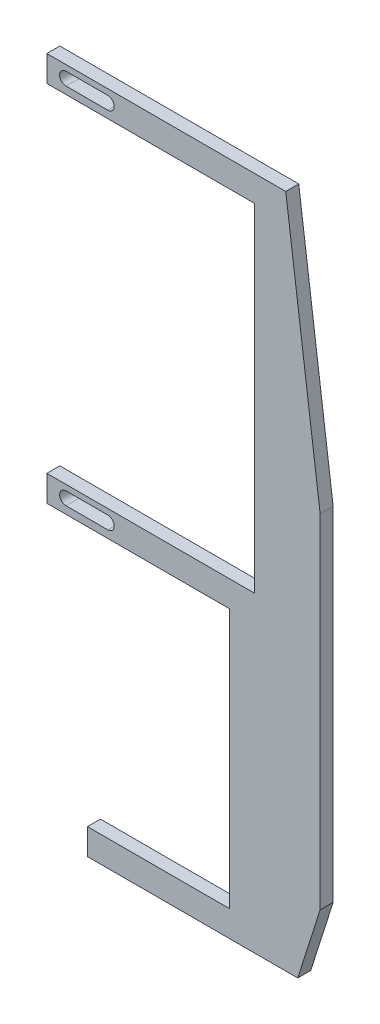
ISO-10303-21;
HEADER;
FILE_DESCRIPTION(('STEP AP214'),'2;1');
FILE_NAME('part.step','',(''),(''),'','','');
FILE_SCHEMA(('AUTOMOTIVE_DESIGN { 1 0 10303 214 1 1 1 1 }'));
ENDSEC;
DATA;
#1=APPLICATION_CONTEXT('core data for automotive mechanical design processes');
#2=APPLICATION_PROTOCOL_DEFINITION('international standard','automotive_design',2000,#1);
#3=PRODUCT_CONTEXT('',#1,'mechanical');
#4=PRODUCT('Part','Part','',(#3));
#5=PRODUCT_RELATED_PRODUCT_CATEGORY('part','',(#4));
#6=PRODUCT_DEFINITION_FORMATION('','',#4);
#7=PRODUCT_DEFINITION_CONTEXT('part definition',#1,'design');
#8=PRODUCT_DEFINITION('design','',#6,#7);
#9=PRODUCT_DEFINITION_SHAPE('','',#8);
#10=(LENGTH_UNIT() NAMED_UNIT(*) SI_UNIT(.MILLI.,.METRE.));
#11=(NAMED_UNIT(*) PLANE_ANGLE_UNIT() SI_UNIT($,.RADIAN.));
#12=(NAMED_UNIT(*) SI_UNIT($,.STERADIAN.) SOLID_ANGLE_UNIT());
#13=UNCERTAINTY_MEASURE_WITH_UNIT(LENGTH_MEASURE(1.E-05),#10,'distance_accuracy_value','');
#14=(GEOMETRIC_REPRESENTATION_CONTEXT(3) GLOBAL_UNCERTAINTY_ASSIGNED_CONTEXT((#13)) GLOBAL_UNIT_ASSIGNED_CONTEXT((#10,
#11,#12)) REPRESENTATION_CONTEXT('',''));
#15=CARTESIAN_POINT('',(0.,0.,0.));
#16=DIRECTION('',(0.,0.,1.));
#17=DIRECTION('',(1.,0.,0.));
#18=AXIS2_PLACEMENT_3D('',#15,#16,#17);
#19=CARTESIAN_POINT('',(66.833453825743,-57.719185395784,3.175));
#20=DIRECTION('',(-0.991487693439748,-0.130200436856135,0.));
#21=DIRECTION('',(0.130200436856135,-0.991487693439748,0.));
#22=AXIS2_PLACEMENT_3D('',#19,#20,#21);
#23=PLANE('',#22);
#24=DIRECTION('',(-0.130200436856135,0.991487693439748,0.));
#25=VECTOR('',#24,1.);
#26=CARTESIAN_POINT('',(66.833453825743,-57.719185395784,0.));
#27=LINE('',#26,#25);
#28=CARTESIAN_POINT('',(66.833453825743,-57.719185395784,0.));
#29=VERTEX_POINT('',#28);
#30=CARTESIAN_POINT('',(58.42,6.35000000000001,0.));
#31=VERTEX_POINT('',#30);
#32=EDGE_CURVE('E238',#29,#31,#27,.T.);
#33=ORIENTED_EDGE('',*,*,#32,.T.);
#34=DIRECTION('',(0.,0.,-1.));
#35=VECTOR('',#34,1.);
#36=CARTESIAN_POINT('',(58.42,6.35000000000001,3.175));
#37=LINE('',#36,#35);
#38=CARTESIAN_POINT('',(58.42,6.35000000000001,3.175));
#39=VERTEX_POINT('',#38);
#40=EDGE_CURVE('E11',#39,#31,#37,.T.);
#41=ORIENTED_EDGE('',*,*,#40,.F.);
#42=DIRECTION('',(-0.130200436856135,0.991487693439748,0.));
#43=VECTOR('',#42,1.);
#44=CARTESIAN_POINT('',(66.833453825743,-57.719185395784,3.175));
#45=LINE('',#44,#43);
#46=CARTESIAN_POINT('',(66.833453825743,-57.719185395784,3.175));
#47=VERTEX_POINT('',#46);
#48=EDGE_CURVE('E286',#47,#39,#45,.T.);
#49=ORIENTED_EDGE('',*,*,#48,.F.);
#50=DIRECTION('',(0.,0.,-1.));
#51=VECTOR('',#50,1.);
#52=CARTESIAN_POINT('',(66.833453825743,-57.719185395784,3.175));
#53=LINE('',#52,#51);
#54=EDGE_CURVE('E330',#47,#29,#53,.T.);
#55=ORIENTED_EDGE('',*,*,#54,.T.);
#56=EDGE_LOOP('',(#33,#41,#49,#55));
#57=FACE_BOUND('',#56,.T.);
#58=ADVANCED_FACE('F43',(#57),#23,.F.);
#59=CARTESIAN_POINT('',(58.42,6.35000000000001,3.175));
#60=DIRECTION('',(0.,-1.,0.));
#61=DIRECTION('',(1.,0.,0.));
#62=AXIS2_PLACEMENT_3D('',#59,#60,#61);
#63=PLANE('',#62);
#64=DIRECTION('',(-1.,0.,0.));
#65=VECTOR('',#64,1.);
#66=CARTESIAN_POINT('',(58.42,6.35000000000001,0.));
#67=LINE('',#66,#65);
#68=CARTESIAN_POINT('',(0.,6.35,0.));
#69=VERTEX_POINT('',#68);
#70=EDGE_CURVE('E334',#31,#69,#67,.T.);
#71=ORIENTED_EDGE('',*,*,#70,.T.);
#72=DIRECTION('',(0.,0.,-1.));
#73=VECTOR('',#72,1.);
#74=CARTESIAN_POINT('',(0.,6.35,3.175));
#75=LINE('',#74,#73);
#76=CARTESIAN_POINT('',(0.,6.35,3.175));
#77=VERTEX_POINT('',#76);
#78=EDGE_CURVE('E51',#77,#69,#75,.T.);
#79=ORIENTED_EDGE('',*,*,#78,.F.);
#80=DIRECTION('',(-1.,0.,0.));
#81=VECTOR('',#80,1.);
#82=CARTESIAN_POINT('',(58.42,6.35000000000001,3.175));
#83=LINE('',#82,#81);
#84=EDGE_CURVE('E290',#39,#77,#83,.T.);
#85=ORIENTED_EDGE('',*,*,#84,.F.);
#86=ORIENTED_EDGE('',*,*,#40,.T.);
#87=EDGE_LOOP('',(#71,#79,#85,#86));
#88=FACE_BOUND('',#87,.T.);
#89=ADVANCED_FACE('F446',(#88),#63,.F.);
#90=CARTESIAN_POINT('',(0.,6.35,3.175));
#91=DIRECTION('',(1.,0.,0.));
#92=DIRECTION('',(0.,1.,0.));
#93=AXIS2_PLACEMENT_3D('',#90,#91,#92);
#94=PLANE('',#93);
#95=DIRECTION('',(0.,-1.,0.));
#96=VECTOR('',#95,1.);
#97=CARTESIAN_POINT('',(0.,6.35,0.));
#98=LINE('',#97,#96);
#99=CARTESIAN_POINT('',(0.,0.,0.));
#100=VERTEX_POINT('',#99);
#101=EDGE_CURVE('E337',#69,#100,#98,.T.);
#102=ORIENTED_EDGE('',*,*,#101,.T.);
#103=DIRECTION('',(0.,0.,-1.));
#104=VECTOR('',#103,1.);
#105=CARTESIAN_POINT('',(0.,0.,3.175));
#106=LINE('',#105,#104);
#107=CARTESIAN_POINT('',(0.,0.,3.175));
#108=VERTEX_POINT('',#107);
#109=EDGE_CURVE('E415',#108,#100,#106,.T.);
#110=ORIENTED_EDGE('',*,*,#109,.F.);
#111=DIRECTION('',(0.,-1.,0.));
#112=VECTOR('',#111,1.);
#113=CARTESIAN_POINT('',(0.,6.35,3.175));
#114=LINE('',#113,#112);
#115=EDGE_CURVE('E294',#77,#108,#114,.T.);
#116=ORIENTED_EDGE('',*,*,#115,.F.);
#117=ORIENTED_EDGE('',*,*,#78,.T.);
#118=EDGE_LOOP('',(#102,#110,#116,#117));
#119=FACE_BOUND('',#118,.T.);
#120=ADVANCED_FACE('F424',(#119),#94,.F.);
#121=CARTESIAN_POINT('',(0.,0.,3.175));
#122=DIRECTION('',(0.,1.,0.));
#123=DIRECTION('',(0.,0.,1.));
#124=AXIS2_PLACEMENT_3D('',#121,#122,#123);
#125=PLANE('',#124);
#126=DIRECTION('',(1.,0.,0.));
#127=VECTOR('',#126,1.);
#128=CARTESIAN_POINT('',(0.,0.,0.));
#129=LINE('',#128,#127);
#130=CARTESIAN_POINT('',(50.8,0.,0.));
#131=VERTEX_POINT('',#130);
#132=EDGE_CURVE('E340',#100,#131,#129,.T.);
#133=ORIENTED_EDGE('',*,*,#132,.T.);
#134=DIRECTION('',(0.,0.,-1.));
#135=VECTOR('',#134,1.);
#136=CARTESIAN_POINT('',(50.8,0.,3.175));
#137=LINE('',#136,#135);
#138=CARTESIAN_POINT('',(50.8,0.,3.175));
#139=VERTEX_POINT('',#138);
#140=EDGE_CURVE('E411',#139,#131,#137,.T.);
#141=ORIENTED_EDGE('',*,*,#140,.F.);
#142=DIRECTION('',(1.,0.,0.));
#143=VECTOR('',#142,1.);
#144=CARTESIAN_POINT('',(0.,0.,3.175));
#145=LINE('',#144,#143);
#146=EDGE_CURVE('E297',#108,#139,#145,.T.);
#147=ORIENTED_EDGE('',*,*,#146,.F.);
#148=ORIENTED_EDGE('',*,*,#109,.T.);
#149=EDGE_LOOP('',(#133,#141,#147,#148));
#150=FACE_BOUND('',#149,.T.);
#151=ADVANCED_FACE('F434',(#150),#125,.F.);
#152=CARTESIAN_POINT('',(50.8,0.,3.175));
#153=DIRECTION('',(1.,0.,0.));
#154=DIRECTION('',(0.,1.,0.));
#155=AXIS2_PLACEMENT_3D('',#152,#153,#154);
#156=PLANE('',#155);
#157=DIRECTION('',(0.,-1.,0.));
#158=VECTOR('',#157,1.);
#159=CARTESIAN_POINT('',(50.8,0.,0.));
#160=LINE('',#159,#158);
#161=CARTESIAN_POINT('',(50.8,-82.55,0.));
#162=VERTEX_POINT('',#161);
#163=EDGE_CURVE('E343',#131,#162,#160,.T.);
#164=ORIENTED_EDGE('',*,*,#163,.T.);
#165=DIRECTION('',(0.,0.,-1.));
#166=VECTOR('',#165,1.);
#167=CARTESIAN_POINT('',(50.8,-82.55,3.175));
#168=LINE('',#167,#166);
#169=CARTESIAN_POINT('',(50.8,-82.55,3.175));
#170=VERTEX_POINT('',#169);
#171=EDGE_CURVE('E407',#170,#162,#168,.T.);
#172=ORIENTED_EDGE('',*,*,#171,.F.);
#173=DIRECTION('',(0.,-1.,0.));
#174=VECTOR('',#173,1.);
#175=CARTESIAN_POINT('',(50.8,0.,3.175));
#176=LINE('',#175,#174);
#177=EDGE_CURVE('E300',#139,#170,#176,.T.);
#178=ORIENTED_EDGE('',*,*,#177,.F.);
#179=ORIENTED_EDGE('',*,*,#140,.T.);
#180=EDGE_LOOP('',(#164,#172,#178,#179));
#181=FACE_BOUND('',#180,.T.);
#182=ADVANCED_FACE('F438',(#181),#156,.F.);
#183=CARTESIAN_POINT('',(50.8,-82.55,3.175));
#184=DIRECTION('',(0.,-1.,0.));
#185=DIRECTION('',(0.,0.,-1.));
#186=AXIS2_PLACEMENT_3D('',#183,#184,#185);
#187=PLANE('',#186);
#188=DIRECTION('',(-1.,0.,0.));
#189=VECTOR('',#188,1.);
#190=CARTESIAN_POINT('',(50.8,-82.55,0.));
#191=LINE('',#190,#189);
#192=CARTESIAN_POINT('',(0.,-82.55,0.));
#193=VERTEX_POINT('',#192);
#194=EDGE_CURVE('E346',#162,#193,#191,.T.);
#195=ORIENTED_EDGE('',*,*,#194,.T.);
#196=DIRECTION('',(0.,0.,-1.));
#197=VECTOR('',#196,1.);
#198=CARTESIAN_POINT('',(0.,-82.55,3.175));
#199=LINE('',#198,#197);
#200=CARTESIAN_POINT('',(0.,-82.55,3.175));
#201=VERTEX_POINT('',#200);
#202=EDGE_CURVE('E403',#201,#193,#199,.T.);
#203=ORIENTED_EDGE('',*,*,#202,.F.);
#204=DIRECTION('',(-1.,0.,0.));
#205=VECTOR('',#204,1.);
#206=CARTESIAN_POINT('',(50.8,-82.55,3.175));
#207=LINE('',#206,#205);
#208=EDGE_CURVE('E303',#170,#201,#207,.T.);
#209=ORIENTED_EDGE('',*,*,#208,.F.);
#210=ORIENTED_EDGE('',*,*,#171,.T.);
#211=EDGE_LOOP('',(#195,#203,#209,#210));
#212=FACE_BOUND('',#211,.T.);
#213=ADVANCED_FACE('F489',(#212),#187,.F.);
#214=CARTESIAN_POINT('',(0.,-82.55,3.175));
#215=DIRECTION('',(1.,0.,0.));
#216=DIRECTION('',(0.,1.,0.));
#217=AXIS2_PLACEMENT_3D('',#214,#215,#216);
#218=PLANE('',#217);
#219=DIRECTION('',(0.,-1.,0.));
#220=VECTOR('',#219,1.);
#221=CARTESIAN_POINT('',(0.,-82.55,0.));
#222=LINE('',#221,#220);
#223=CARTESIAN_POINT('',(0.,-88.9,0.));
#224=VERTEX_POINT('',#223);
#225=EDGE_CURVE('E349',#193,#224,#222,.T.);
#226=ORIENTED_EDGE('',*,*,#225,.T.);
#227=DIRECTION('',(0.,0.,-1.));
#228=VECTOR('',#227,1.);
#229=CARTESIAN_POINT('',(0.,-88.9,3.175));
#230=LINE('',#229,#228);
#231=CARTESIAN_POINT('',(0.,-88.9,3.175));
#232=VERTEX_POINT('',#231);
#233=EDGE_CURVE('E399',#232,#224,#230,.T.);
#234=ORIENTED_EDGE('',*,*,#233,.F.);
#235=DIRECTION('',(0.,-1.,0.));
#236=VECTOR('',#235,1.);
#237=CARTESIAN_POINT('',(0.,-82.55,3.175));
#238=LINE('',#237,#236);
#239=EDGE_CURVE('E306',#201,#232,#238,.T.);
#240=ORIENTED_EDGE('',*,*,#239,.F.);
#241=ORIENTED_EDGE('',*,*,#202,.T.);
#242=EDGE_LOOP('',(#226,#234,#240,#241));
#243=FACE_BOUND('',#242,.T.);
#244=ADVANCED_FACE('F487',(#243),#218,.F.);
#245=CARTESIAN_POINT('',(0.,-88.9,3.175));
#246=DIRECTION('',(0.,1.,0.));
#247=DIRECTION('',(0.,0.,1.));
#248=AXIS2_PLACEMENT_3D('',#245,#246,#247);
#249=PLANE('',#248);
#250=DIRECTION('',(1.,0.,0.));
#251=VECTOR('',#250,1.);
#252=CARTESIAN_POINT('',(0.,-88.9,0.));
#253=LINE('',#252,#251);
#254=CARTESIAN_POINT('',(44.7212032325067,-88.9,0.));
#255=VERTEX_POINT('',#254);
#256=EDGE_CURVE('E352',#224,#255,#253,.T.);
#257=ORIENTED_EDGE('',*,*,#256,.T.);
#258=DIRECTION('',(0.,0.,-1.));
#259=VECTOR('',#258,1.);
#260=CARTESIAN_POINT('',(44.7212032325067,-88.9,3.175));
#261=LINE('',#260,#259);
#262=CARTESIAN_POINT('',(44.7212032325067,-88.9,3.175));
#263=VERTEX_POINT('',#262);
#264=EDGE_CURVE('E395',#263,#255,#261,.T.);
#265=ORIENTED_EDGE('',*,*,#264,.F.);
#266=DIRECTION('',(1.,0.,0.));
#267=VECTOR('',#266,1.);
#268=CARTESIAN_POINT('',(0.,-88.9,3.175));
#269=LINE('',#268,#267);
#270=EDGE_CURVE('E309',#232,#263,#269,.T.);
#271=ORIENTED_EDGE('',*,*,#270,.F.);
#272=ORIENTED_EDGE('',*,*,#233,.T.);
#273=EDGE_LOOP('',(#257,#265,#271,#272));
#274=FACE_BOUND('',#273,.T.);
#275=ADVANCED_FACE('F482',(#274),#249,.F.);
#276=CARTESIAN_POINT('',(44.7212032325067,-88.9,3.175));
#277=DIRECTION('',(1.,0.,0.));
#278=DIRECTION('',(0.,1.,0.));
#279=AXIS2_PLACEMENT_3D('',#276,#277,#278);
#280=PLANE('',#279);
#281=DIRECTION('',(0.,-1.,0.));
#282=VECTOR('',#281,1.);
#283=CARTESIAN_POINT('',(44.7212032325067,-88.9,0.));
#284=LINE('',#283,#282);
#285=CARTESIAN_POINT('',(44.7212032325068,-152.4,0.));
#286=VERTEX_POINT('',#285);
#287=EDGE_CURVE('E355',#255,#286,#284,.T.);
#288=ORIENTED_EDGE('',*,*,#287,.T.);
#289=DIRECTION('',(0.,0.,-1.));
#290=VECTOR('',#289,1.);
#291=CARTESIAN_POINT('',(44.7212032325068,-152.4,3.175));
#292=LINE('',#291,#290);
#293=CARTESIAN_POINT('',(44.7212032325068,-152.4,3.175));
#294=VERTEX_POINT('',#293);
#295=EDGE_CURVE('E391',#294,#286,#292,.T.);
#296=ORIENTED_EDGE('',*,*,#295,.F.);
#297=DIRECTION('',(0.,-1.,0.));
#298=VECTOR('',#297,1.);
#299=CARTESIAN_POINT('',(44.7212032325067,-88.9,3.175));
#300=LINE('',#299,#298);
#301=EDGE_CURVE('E312',#263,#294,#300,.T.);
#302=ORIENTED_EDGE('',*,*,#301,.F.);
#303=ORIENTED_EDGE('',*,*,#264,.T.);
#304=EDGE_LOOP('',(#288,#296,#302,#303));
#305=FACE_BOUND('',#304,.T.);
#306=ADVANCED_FACE('F477',(#305),#280,.F.);
#307=CARTESIAN_POINT('',(44.7212032325068,-152.4,3.175));
#308=DIRECTION('',(0.,-1.,0.));
#309=DIRECTION('',(0.,0.,-1.));
#310=AXIS2_PLACEMENT_3D('',#307,#308,#309);
#311=PLANE('',#310);
#312=DIRECTION('',(-1.,0.,0.));
#313=VECTOR('',#312,1.);
#314=CARTESIAN_POINT('',(44.7212032325068,-152.4,0.));
#315=LINE('',#314,#313);
#316=CARTESIAN_POINT('',(9.92815184908972,-152.4,0.));
#317=VERTEX_POINT('',#316);
#318=EDGE_CURVE('E358',#286,#317,#315,.T.);
#319=ORIENTED_EDGE('',*,*,#318,.T.);
#320=DIRECTION('',(0.,0.,-1.));
#321=VECTOR('',#320,1.);
#322=CARTESIAN_POINT('',(9.92815184908972,-152.4,3.175));
#323=LINE('',#322,#321);
#324=CARTESIAN_POINT('',(9.92815184908972,-152.4,3.175));
#325=VERTEX_POINT('',#324);
#326=EDGE_CURVE('E387',#325,#317,#323,.T.);
#327=ORIENTED_EDGE('',*,*,#326,.F.);
#328=DIRECTION('',(-1.,0.,0.));
#329=VECTOR('',#328,1.);
#330=CARTESIAN_POINT('',(44.7212032325068,-152.4,3.175));
#331=LINE('',#330,#329);
#332=EDGE_CURVE('E315',#294,#325,#331,.T.);
#333=ORIENTED_EDGE('',*,*,#332,.F.);
#334=ORIENTED_EDGE('',*,*,#295,.T.);
#335=EDGE_LOOP('',(#319,#327,#333,#334));
#336=FACE_BOUND('',#335,.T.);
#337=ADVANCED_FACE('F473',(#336),#311,.F.);
#338=CARTESIAN_POINT('',(9.92815184908972,-152.4,3.175));
#339=DIRECTION('',(1.,0.,0.));
#340=DIRECTION('',(0.,0.,-1.));
#341=AXIS2_PLACEMENT_3D('',#338,#339,#340);
#342=PLANE('',#341);
#343=DIRECTION('',(0.,-1.,0.));
#344=VECTOR('',#343,1.);
#345=CARTESIAN_POINT('',(9.92815184908972,-152.4,0.));
#346=LINE('',#345,#344);
#347=CARTESIAN_POINT('',(9.92815184908972,-158.75,0.));
#348=VERTEX_POINT('',#347);
#349=EDGE_CURVE('E361',#317,#348,#346,.T.);
#350=ORIENTED_EDGE('',*,*,#349,.T.);
#351=DIRECTION('',(0.,0.,-1.));
#352=VECTOR('',#351,1.);
#353=CARTESIAN_POINT('',(9.92815184908972,-158.75,3.175));
#354=LINE('',#353,#352);
#355=CARTESIAN_POINT('',(9.92815184908972,-158.75,3.175));
#356=VERTEX_POINT('',#355);
#357=EDGE_CURVE('E383',#356,#348,#354,.T.);
#358=ORIENTED_EDGE('',*,*,#357,.F.);
#359=DIRECTION('',(0.,-1.,0.));
#360=VECTOR('',#359,1.);
#361=CARTESIAN_POINT('',(9.92815184908972,-152.4,3.175));
#362=LINE('',#361,#360);
#363=EDGE_CURVE('E318',#325,#356,#362,.T.);
#364=ORIENTED_EDGE('',*,*,#363,.F.);
#365=ORIENTED_EDGE('',*,*,#326,.T.);
#366=EDGE_LOOP('',(#350,#358,#364,#365));
#367=FACE_BOUND('',#366,.T.);
#368=ADVANCED_FACE('F468',(#367),#342,.F.);
#369=CARTESIAN_POINT('',(9.92815184908972,-158.75,3.175));
#370=DIRECTION('',(0.,1.,0.));
#371=DIRECTION('',(0.,0.,1.));
#372=AXIS2_PLACEMENT_3D('',#369,#370,#371);
#373=PLANE('',#372);
#374=DIRECTION('',(1.,0.,0.));
#375=VECTOR('',#374,1.);
#376=CARTESIAN_POINT('',(9.92815184908972,-158.75,0.));
#377=LINE('',#376,#375);
#378=CARTESIAN_POINT('',(61.3451541735366,-158.75,0.));
#379=VERTEX_POINT('',#378);
#380=EDGE_CURVE('E364',#348,#379,#377,.T.);
#381=ORIENTED_EDGE('',*,*,#380,.T.);
#382=DIRECTION('',(0.,0.,-1.));
#383=VECTOR('',#382,1.);
#384=CARTESIAN_POINT('',(61.3451541735366,-158.75,3.175));
#385=LINE('',#384,#383);
#386=CARTESIAN_POINT('',(61.3451541735366,-158.75,3.175));
#387=VERTEX_POINT('',#386);
#388=EDGE_CURVE('E379',#387,#379,#385,.T.);
#389=ORIENTED_EDGE('',*,*,#388,.F.);
#390=DIRECTION('',(1.,0.,0.));
#391=VECTOR('',#390,1.);
#392=CARTESIAN_POINT('',(9.92815184908972,-158.75,3.175));
#393=LINE('',#392,#391);
#394=EDGE_CURVE('E321',#356,#387,#393,.T.);
#395=ORIENTED_EDGE('',*,*,#394,.F.);
#396=ORIENTED_EDGE('',*,*,#357,.T.);
#397=EDGE_LOOP('',(#381,#389,#395,#396));
#398=FACE_BOUND('',#397,.T.);
#399=ADVANCED_FACE('F462',(#398),#373,.F.);
#400=CARTESIAN_POINT('',(61.3451541735366,-158.75,3.175));
#401=DIRECTION('',(-0.952546050407582,0.304394516791804,0.));
#402=DIRECTION('',(-0.304394516791804,-0.952546050407582,0.));
#403=AXIS2_PLACEMENT_3D('',#400,#401,#402);
#404=PLANE('',#403);
#405=DIRECTION('',(0.304394516791804,0.952546050407582,0.));
#406=VECTOR('',#405,1.);
#407=CARTESIAN_POINT('',(61.3451541735366,-158.75,0.));
#408=LINE('',#407,#406);
#409=CARTESIAN_POINT('',(66.833453825743,-141.575386566545,0.));
#410=VERTEX_POINT('',#409);
#411=EDGE_CURVE('E367',#379,#410,#408,.T.);
#412=ORIENTED_EDGE('',*,*,#411,.T.);
#413=DIRECTION('',(0.,0.,-1.));
#414=VECTOR('',#413,1.);
#415=CARTESIAN_POINT('',(66.833453825743,-141.575386566545,3.175));
#416=LINE('',#415,#414);
#417=CARTESIAN_POINT('',(66.833453825743,-141.575386566545,3.175));
#418=VERTEX_POINT('',#417);
#419=EDGE_CURVE('E375',#418,#410,#416,.T.);
#420=ORIENTED_EDGE('',*,*,#419,.F.);
#421=DIRECTION('',(0.304394516791804,0.952546050407582,0.));
#422=VECTOR('',#421,1.);
#423=CARTESIAN_POINT('',(61.3451541735366,-158.75,3.175));
#424=LINE('',#423,#422);
#425=EDGE_CURVE('E324',#387,#418,#424,.T.);
#426=ORIENTED_EDGE('',*,*,#425,.F.);
#427=ORIENTED_EDGE('',*,*,#388,.T.);
#428=EDGE_LOOP('',(#412,#420,#426,#427));
#429=FACE_BOUND('',#428,.T.);
#430=ADVANCED_FACE('F458',(#429),#404,.F.);
#431=CARTESIAN_POINT('',(66.833453825743,-141.575386566545,3.175));
#432=DIRECTION('',(-1.,0.,0.));
#433=DIRECTION('',(0.,0.,1.));
#434=AXIS2_PLACEMENT_3D('',#431,#432,#433);
#435=PLANE('',#434);
#436=DIRECTION('',(0.,1.,0.));
#437=VECTOR('',#436,1.);
#438=CARTESIAN_POINT('',(66.833453825743,-141.575386566545,0.));
#439=LINE('',#438,#437);
#440=EDGE_CURVE('E291',#410,#29,#439,.T.);
#441=ORIENTED_EDGE('',*,*,#440,.T.);
#442=ORIENTED_EDGE('',*,*,#54,.F.);
#443=DIRECTION('',(0.,1.,0.));
#444=VECTOR('',#443,1.);
#445=CARTESIAN_POINT('',(66.833453825743,-141.575386566545,3.175));
#446=LINE('',#445,#444);
#447=EDGE_CURVE('E327',#418,#47,#446,.T.);
#448=ORIENTED_EDGE('',*,*,#447,.F.);
#449=ORIENTED_EDGE('',*,*,#419,.T.);
#450=EDGE_LOOP('',(#441,#442,#448,#449));
#451=FACE_BOUND('',#450,.T.);
#452=ADVANCED_FACE('F453',(#451),#435,.F.);
#453=CARTESIAN_POINT('',(0.,0.,3.175));
#454=DIRECTION('',(0.,0.,1.));
#455=DIRECTION('',(1.,0.,0.));
#456=AXIS2_PLACEMENT_3D('',#453,#454,#455);
#457=PLANE('',#456);
#458=CARTESIAN_POINT('',(4.69613835657531,3.36827604233707,3.175));
#459=DIRECTION('',(0.,0.,1.));
#460=DIRECTION('',(1.,0.,0.));
#461=AXIS2_PLACEMENT_3D('',#458,#459,#460);
#462=CIRCLE('',#461,1.56826220363582);
#463=CARTESIAN_POINT('',(4.69613835657531,4.93653824597288,3.175));
#464=VERTEX_POINT('',#463);
#465=CARTESIAN_POINT('',(4.69613835657531,1.80001383870125,3.175));
#466=VERTEX_POINT('',#465);
#467=EDGE_CURVE('E58',#464,#466,#462,.T.);
#468=ORIENTED_EDGE('',*,*,#467,.F.);
#469=DIRECTION('',(-1.,0.,0.));
#470=VECTOR('',#469,1.);
#471=CARTESIAN_POINT('',(4.69613835657531,4.93653824597288,3.175));
#472=LINE('',#471,#470);
#473=CARTESIAN_POINT('',(14.893802938298,4.93653824597288,3.175));
#474=VERTEX_POINT('',#473);
#475=EDGE_CURVE('E216',#474,#464,#472,.T.);
#476=ORIENTED_EDGE('',*,*,#475,.F.);
#477=CARTESIAN_POINT('',(14.893802938298,3.36827604233707,3.175));
#478=DIRECTION('',(0.,0.,1.));
#479=DIRECTION('',(1.,0.,0.));
#480=AXIS2_PLACEMENT_3D('',#477,#478,#479);
#481=CIRCLE('',#480,1.56826220363582);
#482=CARTESIAN_POINT('',(14.893802938298,1.80001383870125,3.175));
#483=VERTEX_POINT('',#482);
#484=EDGE_CURVE('E220',#483,#474,#481,.T.);
#485=ORIENTED_EDGE('',*,*,#484,.F.);
#486=DIRECTION('',(1.,0.,0.));
#487=VECTOR('',#486,1.);
#488=CARTESIAN_POINT('',(4.69613835657531,1.80001383870125,3.175));
#489=LINE('',#488,#487);
#490=EDGE_CURVE('E229',#466,#483,#489,.T.);
#491=ORIENTED_EDGE('',*,*,#490,.F.);
#492=EDGE_LOOP('',(#468,#476,#485,#491));
#493=FACE_BOUND('',#492,.T.);
#494=CARTESIAN_POINT('',(4.69613835657533,-85.4979353679799,3.175));
#495=DIRECTION('',(0.,0.,1.));
#496=DIRECTION('',(1.,0.,0.));
#497=AXIS2_PLACEMENT_3D('',#494,#495,#496);
#498=CIRCLE('',#497,1.56826220363582);
#499=CARTESIAN_POINT('',(4.69613835657533,-83.9296731643441,3.175));
#500=VERTEX_POINT('',#499);
#501=CARTESIAN_POINT('',(4.69613835657533,-87.0661975716158,3.175));
#502=VERTEX_POINT('',#501);
#503=EDGE_CURVE('E66',#500,#502,#498,.T.);
#504=ORIENTED_EDGE('',*,*,#503,.F.);
#505=DIRECTION('',(-1.,0.,0.));
#506=VECTOR('',#505,1.);
#507=CARTESIAN_POINT('',(4.69613835657533,-83.9296731643441,3.175));
#508=LINE('',#507,#506);
#509=CARTESIAN_POINT('',(14.893802938298,-83.9296731643441,3.175));
#510=VERTEX_POINT('',#509);
#511=EDGE_CURVE('E257',#510,#500,#508,.T.);
#512=ORIENTED_EDGE('',*,*,#511,.F.);
#513=CARTESIAN_POINT('',(14.893802938298,-85.4979353679799,3.175));
#514=DIRECTION('',(0.,0.,1.));
#515=DIRECTION('',(1.,0.,0.));
#516=AXIS2_PLACEMENT_3D('',#513,#514,#515);
#517=CIRCLE('',#516,1.56826220363582);
#518=CARTESIAN_POINT('',(14.893802938298,-87.0661975716158,3.175));
#519=VERTEX_POINT('',#518);
#520=EDGE_CURVE('E261',#519,#510,#517,.T.);
#521=ORIENTED_EDGE('',*,*,#520,.F.);
#522=DIRECTION('',(1.,0.,0.));
#523=VECTOR('',#522,1.);
#524=CARTESIAN_POINT('',(4.69613835657533,-87.0661975716158,3.175));
#525=LINE('',#524,#523);
#526=EDGE_CURVE('E266',#502,#519,#525,.T.);
#527=ORIENTED_EDGE('',*,*,#526,.F.);
#528=EDGE_LOOP('',(#504,#512,#521,#527));
#529=FACE_BOUND('',#528,.T.);
#530=ORIENTED_EDGE('',*,*,#48,.T.);
#531=ORIENTED_EDGE('',*,*,#84,.T.);
#532=ORIENTED_EDGE('',*,*,#115,.T.);
#533=ORIENTED_EDGE('',*,*,#146,.T.);
#534=ORIENTED_EDGE('',*,*,#177,.T.);
#535=ORIENTED_EDGE('',*,*,#208,.T.);
#536=ORIENTED_EDGE('',*,*,#239,.T.);
#537=ORIENTED_EDGE('',*,*,#270,.T.);
#538=ORIENTED_EDGE('',*,*,#301,.T.);
#539=ORIENTED_EDGE('',*,*,#332,.T.);
#540=ORIENTED_EDGE('',*,*,#363,.T.);
#541=ORIENTED_EDGE('',*,*,#394,.T.);
#542=ORIENTED_EDGE('',*,*,#425,.T.);
#543=ORIENTED_EDGE('',*,*,#447,.T.);
#544=EDGE_LOOP('',(#530,#531,#532,#533,#534,#535,#536,#537,#538,#539,#540,#541,#542,#543));
#545=FACE_BOUND('',#544,.T.);
#546=ADVANCED_FACE('F442',(#493,#529,#545),#457,.T.);
#547=CARTESIAN_POINT('',(0.,0.,0.));
#548=DIRECTION('',(0.,0.,1.));
#549=DIRECTION('',(1.,0.,0.));
#550=AXIS2_PLACEMENT_3D('',#547,#548,#549);
#551=PLANE('',#550);
#552=DIRECTION('',(-1.,0.,0.));
#553=VECTOR('',#552,1.);
#554=CARTESIAN_POINT('',(4.69613835657531,4.93653824597288,0.));
#555=LINE('',#554,#553);
#556=CARTESIAN_POINT('',(14.893802938298,4.93653824597288,0.));
#557=VERTEX_POINT('',#556);
#558=CARTESIAN_POINT('',(4.69613835657531,4.93653824597288,0.));
#559=VERTEX_POINT('',#558);
#560=EDGE_CURVE('E201',#557,#559,#555,.T.);
#561=ORIENTED_EDGE('',*,*,#560,.T.);
#562=CARTESIAN_POINT('',(4.69613835657531,3.36827604233707,0.));
#563=DIRECTION('',(0.,0.,1.));
#564=DIRECTION('',(1.,0.,0.));
#565=AXIS2_PLACEMENT_3D('',#562,#563,#564);
#566=CIRCLE('',#565,1.56826220363582);
#567=CARTESIAN_POINT('',(4.69613835657531,1.80001383870125,0.));
#568=VERTEX_POINT('',#567);
#569=EDGE_CURVE('E194',#559,#568,#566,.T.);
#570=ORIENTED_EDGE('',*,*,#569,.T.);
#571=DIRECTION('',(1.,0.,0.));
#572=VECTOR('',#571,1.);
#573=CARTESIAN_POINT('',(4.69613835657531,1.80001383870125,0.));
#574=LINE('',#573,#572);
#575=CARTESIAN_POINT('',(14.893802938298,1.80001383870125,0.));
#576=VERTEX_POINT('',#575);
#577=EDGE_CURVE('E205',#568,#576,#574,.T.);
#578=ORIENTED_EDGE('',*,*,#577,.T.);
#579=CARTESIAN_POINT('',(14.893802938298,3.36827604233707,0.));
#580=DIRECTION('',(0.,0.,1.));
#581=DIRECTION('',(1.,0.,0.));
#582=AXIS2_PLACEMENT_3D('',#579,#580,#581);
#583=CIRCLE('',#582,1.56826220363582);
#584=EDGE_CURVE('E210',#576,#557,#583,.T.);
#585=ORIENTED_EDGE('',*,*,#584,.T.);
#586=EDGE_LOOP('',(#561,#570,#578,#585));
#587=FACE_BOUND('',#586,.T.);
#588=DIRECTION('',(-1.,0.,0.));
#589=VECTOR('',#588,1.);
#590=CARTESIAN_POINT('',(4.69613835657533,-83.9296731643441,0.));
#591=LINE('',#590,#589);
#592=CARTESIAN_POINT('',(14.893802938298,-83.9296731643441,0.));
#593=VERTEX_POINT('',#592);
#594=CARTESIAN_POINT('',(4.69613835657533,-83.9296731643441,0.));
#595=VERTEX_POINT('',#594);
#596=EDGE_CURVE('E247',#593,#595,#591,.T.);
#597=ORIENTED_EDGE('',*,*,#596,.T.);
#598=CARTESIAN_POINT('',(4.69613835657533,-85.4979353679799,0.));
#599=DIRECTION('',(0.,0.,1.));
#600=DIRECTION('',(1.,0.,0.));
#601=AXIS2_PLACEMENT_3D('',#598,#599,#600);
#602=CIRCLE('',#601,1.56826220363582);
#603=CARTESIAN_POINT('',(4.69613835657533,-87.0661975716158,0.));
#604=VERTEX_POINT('',#603);
#605=EDGE_CURVE('E262',#595,#604,#602,.T.);
#606=ORIENTED_EDGE('',*,*,#605,.T.);
#607=DIRECTION('',(1.,0.,0.));
#608=VECTOR('',#607,1.);
#609=CARTESIAN_POINT('',(4.69613835657533,-87.0661975716158,0.));
#610=LINE('',#609,#608);
#611=CARTESIAN_POINT('',(14.893802938298,-87.0661975716158,0.));
#612=VERTEX_POINT('',#611);
#613=EDGE_CURVE('E279',#604,#612,#610,.T.);
#614=ORIENTED_EDGE('',*,*,#613,.T.);
#615=CARTESIAN_POINT('',(14.893802938298,-85.4979353679799,0.));
#616=DIRECTION('',(0.,0.,1.));
#617=DIRECTION('',(1.,0.,0.));
#618=AXIS2_PLACEMENT_3D('',#615,#616,#617);
#619=CIRCLE('',#618,1.56826220363582);
#620=EDGE_CURVE('E275',#612,#593,#619,.T.);
#621=ORIENTED_EDGE('',*,*,#620,.T.);
#622=EDGE_LOOP('',(#597,#606,#614,#621));
#623=FACE_BOUND('',#622,.T.);
#624=ORIENTED_EDGE('',*,*,#32,.F.);
#625=ORIENTED_EDGE('',*,*,#440,.F.);
#626=ORIENTED_EDGE('',*,*,#411,.F.);
#627=ORIENTED_EDGE('',*,*,#380,.F.);
#628=ORIENTED_EDGE('',*,*,#349,.F.);
#629=ORIENTED_EDGE('',*,*,#318,.F.);
#630=ORIENTED_EDGE('',*,*,#287,.F.);
#631=ORIENTED_EDGE('',*,*,#256,.F.);
#632=ORIENTED_EDGE('',*,*,#225,.F.);
#633=ORIENTED_EDGE('',*,*,#194,.F.);
#634=ORIENTED_EDGE('',*,*,#163,.F.);
#635=ORIENTED_EDGE('',*,*,#132,.F.);
#636=ORIENTED_EDGE('',*,*,#101,.F.);
#637=ORIENTED_EDGE('',*,*,#70,.F.);
#638=EDGE_LOOP('',(#624,#625,#626,#627,#628,#629,#630,#631,#632,#633,#634,#635,#636,#637));
#639=FACE_BOUND('',#638,.T.);
#640=ADVANCED_FACE('F212',(#587,#623,#639),#551,.F.);
#641=CARTESIAN_POINT('',(4.69613835657533,-85.4979353679799,0.));
#642=DIRECTION('',(0.,0.,1.));
#643=DIRECTION('',(1.,0.,0.));
#644=AXIS2_PLACEMENT_3D('',#641,#642,#643);
#645=CYLINDRICAL_SURFACE('',#644,1.56826220363582);
#646=ORIENTED_EDGE('',*,*,#503,.T.);
#647=DIRECTION('',(0.,0.,1.));
#648=VECTOR('',#647,1.);
#649=CARTESIAN_POINT('',(4.69613835657533,-87.0661975716158,0.));
#650=LINE('',#649,#648);
#651=EDGE_CURVE('E244',#604,#502,#650,.T.);
#652=ORIENTED_EDGE('',*,*,#651,.F.);
#653=ORIENTED_EDGE('',*,*,#605,.F.);
#654=DIRECTION('',(0.,0.,1.));
#655=VECTOR('',#654,1.);
#656=CARTESIAN_POINT('',(4.69613835657533,-83.9296731643441,0.));
#657=LINE('',#656,#655);
#658=EDGE_CURVE('E254',#595,#500,#657,.T.);
#659=ORIENTED_EDGE('',*,*,#658,.T.);
#660=EDGE_LOOP('',(#646,#652,#653,#659));
#661=FACE_BOUND('',#660,.T.);
#662=ADVANCED_FACE('F611',(#661),#645,.F.);
#663=CARTESIAN_POINT('',(4.69613835657533,-83.9296731643441,0.));
#664=DIRECTION('',(0.,1.,0.));
#665=DIRECTION('',(0.,0.,1.));
#666=AXIS2_PLACEMENT_3D('',#663,#664,#665);
#667=PLANE('',#666);
#668=ORIENTED_EDGE('',*,*,#511,.T.);
#669=ORIENTED_EDGE('',*,*,#658,.F.);
#670=ORIENTED_EDGE('',*,*,#596,.F.);
#671=DIRECTION('',(0.,0.,1.));
#672=VECTOR('',#671,1.);
#673=CARTESIAN_POINT('',(14.893802938298,-83.9296731643441,0.));
#674=LINE('',#673,#672);
#675=EDGE_CURVE('E251',#593,#510,#674,.T.);
#676=ORIENTED_EDGE('',*,*,#675,.T.);
#677=EDGE_LOOP('',(#668,#669,#670,#676));
#678=FACE_BOUND('',#677,.T.);
#679=ADVANCED_FACE('F621',(#678),#667,.F.);
#680=CARTESIAN_POINT('',(14.893802938298,-85.4979353679799,0.));
#681=DIRECTION('',(0.,0.,1.));
#682=DIRECTION('',(1.,0.,0.));
#683=AXIS2_PLACEMENT_3D('',#680,#681,#682);
#684=CYLINDRICAL_SURFACE('',#683,1.56826220363582);
#685=ORIENTED_EDGE('',*,*,#520,.T.);
#686=ORIENTED_EDGE('',*,*,#675,.F.);
#687=ORIENTED_EDGE('',*,*,#620,.F.);
#688=DIRECTION('',(0.,0.,1.));
#689=VECTOR('',#688,1.);
#690=CARTESIAN_POINT('',(14.893802938298,-87.0661975716158,0.));
#691=LINE('',#690,#689);
#692=EDGE_CURVE('E248',#612,#519,#691,.T.);
#693=ORIENTED_EDGE('',*,*,#692,.T.);
#694=EDGE_LOOP('',(#685,#686,#687,#693));
#695=FACE_BOUND('',#694,.T.);
#696=ADVANCED_FACE('F631',(#695),#684,.F.);
#697=CARTESIAN_POINT('',(4.69613835657533,-87.0661975716158,0.));
#698=DIRECTION('',(0.,-1.,0.));
#699=DIRECTION('',(0.,0.,-1.));
#700=AXIS2_PLACEMENT_3D('',#697,#698,#699);
#701=PLANE('',#700);
#702=ORIENTED_EDGE('',*,*,#526,.T.);
#703=ORIENTED_EDGE('',*,*,#692,.F.);
#704=ORIENTED_EDGE('',*,*,#613,.F.);
#705=ORIENTED_EDGE('',*,*,#651,.T.);
#706=EDGE_LOOP('',(#702,#703,#704,#705));
#707=FACE_BOUND('',#706,.T.);
#708=ADVANCED_FACE('F642',(#707),#701,.F.);
#709=CARTESIAN_POINT('',(4.69613835657531,3.36827604233707,0.));
#710=DIRECTION('',(0.,0.,1.));
#711=DIRECTION('',(1.,0.,0.));
#712=AXIS2_PLACEMENT_3D('',#709,#710,#711);
#713=CYLINDRICAL_SURFACE('',#712,1.56826220363582);
#714=ORIENTED_EDGE('',*,*,#467,.T.);
#715=DIRECTION('',(0.,0.,1.));
#716=VECTOR('',#715,1.);
#717=CARTESIAN_POINT('',(4.69613835657531,1.80001383870125,0.));
#718=LINE('',#717,#716);
#719=EDGE_CURVE('E190',#568,#466,#718,.T.);
#720=ORIENTED_EDGE('',*,*,#719,.F.);
#721=ORIENTED_EDGE('',*,*,#569,.F.);
#722=DIRECTION('',(0.,0.,1.));
#723=VECTOR('',#722,1.);
#724=CARTESIAN_POINT('',(4.69613835657531,4.93653824597288,0.));
#725=LINE('',#724,#723);
#726=EDGE_CURVE('E235',#559,#464,#725,.T.);
#727=ORIENTED_EDGE('',*,*,#726,.T.);
#728=EDGE_LOOP('',(#714,#720,#721,#727));
#729=FACE_BOUND('',#728,.T.);
#730=ADVANCED_FACE('F192',(#729),#713,.F.);
#731=CARTESIAN_POINT('',(4.69613835657531,4.93653824597288,0.));
#732=DIRECTION('',(0.,1.,0.));
#733=DIRECTION('',(0.,0.,1.));
#734=AXIS2_PLACEMENT_3D('',#731,#732,#733);
#735=PLANE('',#734);
#736=ORIENTED_EDGE('',*,*,#475,.T.);
#737=ORIENTED_EDGE('',*,*,#726,.F.);
#738=ORIENTED_EDGE('',*,*,#560,.F.);
#739=DIRECTION('',(0.,0.,1.));
#740=VECTOR('',#739,1.);
#741=CARTESIAN_POINT('',(14.893802938298,4.93653824597288,0.));
#742=LINE('',#741,#740);
#743=EDGE_CURVE('E239',#557,#474,#742,.T.);
#744=ORIENTED_EDGE('',*,*,#743,.T.);
#745=EDGE_LOOP('',(#736,#737,#738,#744));
#746=FACE_BOUND('',#745,.T.);
#747=ADVANCED_FACE('F663',(#746),#735,.F.);
#748=CARTESIAN_POINT('',(14.893802938298,3.36827604233707,0.));
#749=DIRECTION('',(0.,0.,1.));
#750=DIRECTION('',(1.,0.,0.));
#751=AXIS2_PLACEMENT_3D('',#748,#749,#750);
#752=CYLINDRICAL_SURFACE('',#751,1.56826220363582);
#753=ORIENTED_EDGE('',*,*,#484,.T.);
#754=ORIENTED_EDGE('',*,*,#743,.F.);
#755=ORIENTED_EDGE('',*,*,#584,.F.);
#756=DIRECTION('',(0.,0.,1.));
#757=VECTOR('',#756,1.);
#758=CARTESIAN_POINT('',(14.893802938298,1.80001383870125,0.));
#759=LINE('',#758,#757);
#760=EDGE_CURVE('E200',#576,#483,#759,.T.);
#761=ORIENTED_EDGE('',*,*,#760,.T.);
#762=EDGE_LOOP('',(#753,#754,#755,#761));
#763=FACE_BOUND('',#762,.T.);
#764=ADVANCED_FACE('F673',(#763),#752,.F.);
#765=CARTESIAN_POINT('',(4.69613835657531,1.80001383870125,0.));
#766=DIRECTION('',(0.,-1.,0.));
#767=DIRECTION('',(0.,0.,-1.));
#768=AXIS2_PLACEMENT_3D('',#765,#766,#767);
#769=PLANE('',#768);
#770=ORIENTED_EDGE('',*,*,#490,.T.);
#771=ORIENTED_EDGE('',*,*,#760,.F.);
#772=ORIENTED_EDGE('',*,*,#577,.F.);
#773=ORIENTED_EDGE('',*,*,#719,.T.);
#774=EDGE_LOOP('',(#770,#771,#772,#773));
#775=FACE_BOUND('',#774,.T.);
#776=ADVANCED_FACE('F206',(#775),#769,.F.);
#777=CLOSED_SHELL('',(#58,#89,#120,#151,#182,#213,#244,#275,#306,#337,#368,#399,#430,#452,#546,
#640,#662,#679,#696,#708,#730,#747,#764,#776));
#778=MANIFOLD_SOLID_BREP('B2',#777);
#779=ADVANCED_BREP_SHAPE_REPRESENTATION('',(#18,#778),#14);
#780=SHAPE_DEFINITION_REPRESENTATION(#9,#779);
ENDSEC;
END-ISO-10303-21;
